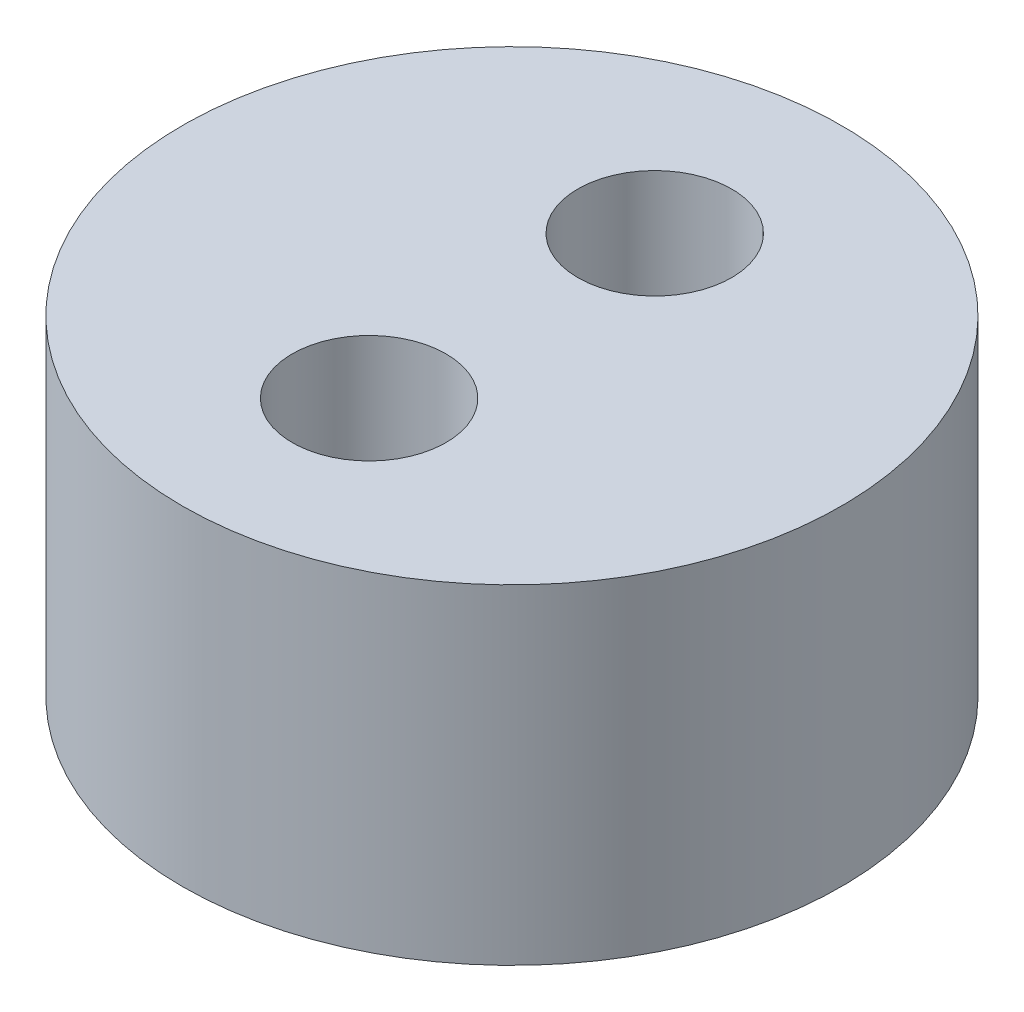
ISO-10303-21;
HEADER;
FILE_DESCRIPTION(('STEP AP214'),'2;1');
FILE_NAME('part.step','',(''),(''),'','','');
FILE_SCHEMA(('AUTOMOTIVE_DESIGN { 1 0 10303 214 1 1 1 1 }'));
ENDSEC;
DATA;
#1=APPLICATION_CONTEXT('core data for automotive mechanical design processes');
#2=APPLICATION_PROTOCOL_DEFINITION('international standard','automotive_design',2000,#1);
#3=PRODUCT_CONTEXT('',#1,'mechanical');
#4=PRODUCT('Part','Part','',(#3));
#5=PRODUCT_RELATED_PRODUCT_CATEGORY('part','',(#4));
#6=PRODUCT_DEFINITION_FORMATION('','',#4);
#7=PRODUCT_DEFINITION_CONTEXT('part definition',#1,'design');
#8=PRODUCT_DEFINITION('design','',#6,#7);
#9=PRODUCT_DEFINITION_SHAPE('','',#8);
#10=(LENGTH_UNIT() NAMED_UNIT(*) SI_UNIT(.MILLI.,.METRE.));
#11=(NAMED_UNIT(*) PLANE_ANGLE_UNIT() SI_UNIT($,.RADIAN.));
#12=(NAMED_UNIT(*) SI_UNIT($,.STERADIAN.) SOLID_ANGLE_UNIT());
#13=UNCERTAINTY_MEASURE_WITH_UNIT(LENGTH_MEASURE(1.E-05),#10,'distance_accuracy_value','');
#14=(GEOMETRIC_REPRESENTATION_CONTEXT(3) GLOBAL_UNCERTAINTY_ASSIGNED_CONTEXT((#13)) GLOBAL_UNIT_ASSIGNED_CONTEXT((#10,
#11,#12)) REPRESENTATION_CONTEXT('',''));
#15=CARTESIAN_POINT('',(0.,0.,0.));
#16=DIRECTION('',(0.,0.,1.));
#17=DIRECTION('',(1.,0.,0.));
#18=AXIS2_PLACEMENT_3D('',#15,#16,#17);
#19=CARTESIAN_POINT('',(0.,3.,0.));
#20=DIRECTION('',(0.,-1.,0.));
#21=DIRECTION('',(0.,0.,-1.));
#22=AXIS2_PLACEMENT_3D('',#19,#20,#21);
#23=CYLINDRICAL_SURFACE('',#22,3.);
#24=CARTESIAN_POINT('',(0.,3.,0.));
#25=DIRECTION('',(0.,1.,0.));
#26=DIRECTION('',(0.,0.,1.));
#27=AXIS2_PLACEMENT_3D('',#24,#25,#26);
#28=CIRCLE('',#27,3.);
#29=CARTESIAN_POINT('',(0.,3.,3.));
#30=VERTEX_POINT('',#29);
#31=EDGE_CURVE('E10',#30,#30,#28,.T.);
#32=ORIENTED_EDGE('',*,*,#31,.F.);
#33=EDGE_LOOP('',(#32));
#34=FACE_BOUND('',#33,.T.);
#35=CARTESIAN_POINT('',(0.,0.,0.));
#36=DIRECTION('',(0.,1.,0.));
#37=DIRECTION('',(0.,0.,1.));
#38=AXIS2_PLACEMENT_3D('',#35,#36,#37);
#39=CIRCLE('',#38,3.);
#40=CARTESIAN_POINT('',(0.,0.,3.));
#41=VERTEX_POINT('',#40);
#42=EDGE_CURVE('E40',#41,#41,#39,.T.);
#43=ORIENTED_EDGE('',*,*,#42,.T.);
#44=EDGE_LOOP('',(#43));
#45=FACE_BOUND('',#44,.T.);
#46=ADVANCED_FACE('F37',(#34,#45),#23,.T.);
#47=CARTESIAN_POINT('',(0.,3.,0.));
#48=DIRECTION('',(0.,1.,0.));
#49=DIRECTION('',(0.,0.,1.));
#50=AXIS2_PLACEMENT_3D('',#47,#48,#49);
#51=PLANE('',#50);
#52=CARTESIAN_POINT('',(0.,3.,-1.30000000000001));
#53=DIRECTION('',(0.,1.,0.));
#54=DIRECTION('',(0.,0.,1.));
#55=AXIS2_PLACEMENT_3D('',#52,#53,#54);
#56=CIRCLE('',#55,0.7);
#57=CARTESIAN_POINT('',(0.,3.,-0.600000000000007));
#58=VERTEX_POINT('',#57);
#59=EDGE_CURVE('E59',#58,#58,#56,.T.);
#60=ORIENTED_EDGE('',*,*,#59,.F.);
#61=EDGE_LOOP('',(#60));
#62=FACE_BOUND('',#61,.T.);
#63=CARTESIAN_POINT('',(0.,3.,1.3));
#64=DIRECTION('',(0.,1.,0.));
#65=DIRECTION('',(0.,0.,-1.));
#66=AXIS2_PLACEMENT_3D('',#63,#64,#65);
#67=CIRCLE('',#66,0.7);
#68=CARTESIAN_POINT('',(0.,3.,0.600000000000005));
#69=VERTEX_POINT('',#68);
#70=EDGE_CURVE('E51',#69,#69,#67,.T.);
#71=ORIENTED_EDGE('',*,*,#70,.F.);
#72=EDGE_LOOP('',(#71));
#73=FACE_BOUND('',#72,.T.);
#74=ORIENTED_EDGE('',*,*,#31,.T.);
#75=EDGE_LOOP('',(#74));
#76=FACE_BOUND('',#75,.T.);
#77=ADVANCED_FACE('F77',(#62,#73,#76),#51,.T.);
#78=CARTESIAN_POINT('',(0.,0.,0.));
#79=DIRECTION('',(0.,1.,0.));
#80=DIRECTION('',(0.,0.,1.));
#81=AXIS2_PLACEMENT_3D('',#78,#79,#80);
#82=PLANE('',#81);
#83=CARTESIAN_POINT('',(0.,0.,-1.30000000000001));
#84=DIRECTION('',(0.,1.,0.));
#85=DIRECTION('',(0.,0.,1.));
#86=AXIS2_PLACEMENT_3D('',#83,#84,#85);
#87=CIRCLE('',#86,0.7);
#88=CARTESIAN_POINT('',(0.,0.,-0.600000000000007));
#89=VERTEX_POINT('',#88);
#90=EDGE_CURVE('E49',#89,#89,#87,.T.);
#91=ORIENTED_EDGE('',*,*,#90,.T.);
#92=EDGE_LOOP('',(#91));
#93=FACE_BOUND('',#92,.T.);
#94=CARTESIAN_POINT('',(0.,0.,1.3));
#95=DIRECTION('',(0.,1.,0.));
#96=DIRECTION('',(0.,0.,-1.));
#97=AXIS2_PLACEMENT_3D('',#94,#95,#96);
#98=CIRCLE('',#97,0.7);
#99=CARTESIAN_POINT('',(0.,0.,0.600000000000005));
#100=VERTEX_POINT('',#99);
#101=EDGE_CURVE('E55',#100,#100,#98,.T.);
#102=ORIENTED_EDGE('',*,*,#101,.T.);
#103=EDGE_LOOP('',(#102));
#104=FACE_BOUND('',#103,.T.);
#105=ORIENTED_EDGE('',*,*,#42,.F.);
#106=EDGE_LOOP('',(#105));
#107=FACE_BOUND('',#106,.T.);
#108=ADVANCED_FACE('F67',(#93,#104,#107),#82,.F.);
#109=CARTESIAN_POINT('',(0.,0.,1.3));
#110=DIRECTION('',(0.,1.,0.));
#111=DIRECTION('',(0.,0.,1.));
#112=AXIS2_PLACEMENT_3D('',#109,#110,#111);
#113=CYLINDRICAL_SURFACE('',#112,0.7);
#114=ORIENTED_EDGE('',*,*,#101,.F.);
#115=EDGE_LOOP('',(#114));
#116=FACE_BOUND('',#115,.T.);
#117=ORIENTED_EDGE('',*,*,#70,.T.);
#118=EDGE_LOOP('',(#117));
#119=FACE_BOUND('',#118,.T.);
#120=ADVANCED_FACE('F73',(#116,#119),#113,.F.);
#121=CARTESIAN_POINT('',(0.,0.,-1.30000000000001));
#122=DIRECTION('',(0.,1.,0.));
#123=DIRECTION('',(0.,0.,1.));
#124=AXIS2_PLACEMENT_3D('',#121,#122,#123);
#125=CYLINDRICAL_SURFACE('',#124,0.7);
#126=ORIENTED_EDGE('',*,*,#90,.F.);
#127=EDGE_LOOP('',(#126));
#128=FACE_BOUND('',#127,.T.);
#129=ORIENTED_EDGE('',*,*,#59,.T.);
#130=EDGE_LOOP('',(#129));
#131=FACE_BOUND('',#130,.T.);
#132=ADVANCED_FACE('F70',(#128,#131),#125,.F.);
#133=CLOSED_SHELL('',(#46,#77,#108,#120,#132));
#134=MANIFOLD_SOLID_BREP('B2',#133);
#135=ADVANCED_BREP_SHAPE_REPRESENTATION('',(#18,#134),#14);
#136=SHAPE_DEFINITION_REPRESENTATION(#9,#135);
ENDSEC;
END-ISO-10303-21;
